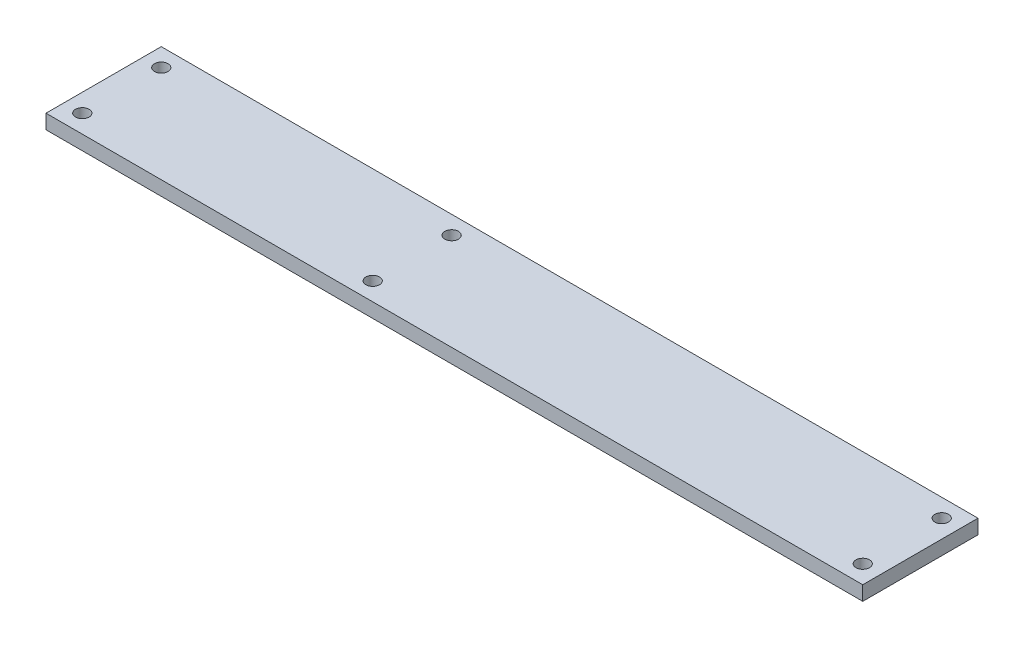
ISO-10303-21;
HEADER;
FILE_DESCRIPTION(('STEP AP214'),'2;1');
FILE_NAME('part.step','',(''),(''),'','','');
FILE_SCHEMA(('AUTOMOTIVE_DESIGN { 1 0 10303 214 1 1 1 1 }'));
ENDSEC;
DATA;
#1=APPLICATION_CONTEXT('core data for automotive mechanical design processes');
#2=APPLICATION_PROTOCOL_DEFINITION('international standard','automotive_design',2000,#1);
#3=PRODUCT_CONTEXT('',#1,'mechanical');
#4=PRODUCT('Part','Part','',(#3));
#5=PRODUCT_RELATED_PRODUCT_CATEGORY('part','',(#4));
#6=PRODUCT_DEFINITION_FORMATION('','',#4);
#7=PRODUCT_DEFINITION_CONTEXT('part definition',#1,'design');
#8=PRODUCT_DEFINITION('design','',#6,#7);
#9=PRODUCT_DEFINITION_SHAPE('','',#8);
#10=(LENGTH_UNIT() NAMED_UNIT(*) SI_UNIT(.MILLI.,.METRE.));
#11=(NAMED_UNIT(*) PLANE_ANGLE_UNIT() SI_UNIT($,.RADIAN.));
#12=(NAMED_UNIT(*) SI_UNIT($,.STERADIAN.) SOLID_ANGLE_UNIT());
#13=UNCERTAINTY_MEASURE_WITH_UNIT(LENGTH_MEASURE(1.E-05),#10,'distance_accuracy_value','');
#14=(GEOMETRIC_REPRESENTATION_CONTEXT(3) GLOBAL_UNCERTAINTY_ASSIGNED_CONTEXT((#13)) GLOBAL_UNIT_ASSIGNED_CONTEXT((#10,
#11,#12)) REPRESENTATION_CONTEXT('',''));
#15=CARTESIAN_POINT('',(0.,0.,0.));
#16=DIRECTION('',(0.,0.,1.));
#17=DIRECTION('',(1.,0.,0.));
#18=AXIS2_PLACEMENT_3D('',#15,#16,#17);
#19=CARTESIAN_POINT('',(0.,3.175,0.));
#20=DIRECTION('',(0.,-1.,0.));
#21=DIRECTION('',(0.,0.,-1.));
#22=AXIS2_PLACEMENT_3D('',#19,#20,#21);
#23=PLANE('',#22);
#24=DIRECTION('',(0.,0.,-1.));
#25=VECTOR('',#24,1.);
#26=CARTESIAN_POINT('',(90.,3.175,12.7));
#27=LINE('',#26,#25);
#28=CARTESIAN_POINT('',(90.,3.175,12.7));
#29=VERTEX_POINT('',#28);
#30=CARTESIAN_POINT('',(90.,3.175,-12.7));
#31=VERTEX_POINT('',#30);
#32=EDGE_CURVE('E86',#29,#31,#27,.T.);
#33=ORIENTED_EDGE('',*,*,#32,.T.);
#34=DIRECTION('',(-1.,0.,0.));
#35=VECTOR('',#34,1.);
#36=CARTESIAN_POINT('',(-90.,3.175,-12.7));
#37=LINE('',#36,#35);
#38=CARTESIAN_POINT('',(-90.,3.175,-12.7));
#39=VERTEX_POINT('',#38);
#40=EDGE_CURVE('E81',#31,#39,#37,.T.);
#41=ORIENTED_EDGE('',*,*,#40,.T.);
#42=DIRECTION('',(0.,0.,1.));
#43=VECTOR('',#42,1.);
#44=CARTESIAN_POINT('',(-90.,3.175,12.7));
#45=LINE('',#44,#43);
#46=CARTESIAN_POINT('',(-90.,3.175,12.7));
#47=VERTEX_POINT('',#46);
#48=EDGE_CURVE('E84',#39,#47,#45,.T.);
#49=ORIENTED_EDGE('',*,*,#48,.T.);
#50=DIRECTION('',(1.,0.,0.));
#51=VECTOR('',#50,1.);
#52=CARTESIAN_POINT('',(-90.,3.175,12.7));
#53=LINE('',#52,#51);
#54=EDGE_CURVE('E51',#47,#29,#53,.T.);
#55=ORIENTED_EDGE('',*,*,#54,.T.);
#56=EDGE_LOOP('',(#33,#41,#49,#55));
#57=FACE_BOUND('',#56,.T.);
#58=CARTESIAN_POINT('',(-86.,3.175,-8.7));
#59=DIRECTION('',(0.,1.,0.));
#60=DIRECTION('',(0.,0.,1.));
#61=AXIS2_PLACEMENT_3D('',#58,#59,#60);
#62=CIRCLE('',#61,1.5);
#63=CARTESIAN_POINT('',(-86.,3.175,-7.2));
#64=VERTEX_POINT('',#63);
#65=EDGE_CURVE('E101',#64,#64,#62,.T.);
#66=ORIENTED_EDGE('',*,*,#65,.F.);
#67=EDGE_LOOP('',(#66));
#68=FACE_BOUND('',#67,.T.);
#69=CARTESIAN_POINT('',(-86.,3.175,8.7));
#70=DIRECTION('',(0.,1.,0.));
#71=DIRECTION('',(0.,0.,1.));
#72=AXIS2_PLACEMENT_3D('',#69,#70,#71);
#73=CIRCLE('',#72,1.5);
#74=CARTESIAN_POINT('',(-86.,3.175,10.2));
#75=VERTEX_POINT('',#74);
#76=EDGE_CURVE('E116',#75,#75,#73,.T.);
#77=ORIENTED_EDGE('',*,*,#76,.F.);
#78=EDGE_LOOP('',(#77));
#79=FACE_BOUND('',#78,.T.);
#80=CARTESIAN_POINT('',(86.,3.175,8.7));
#81=DIRECTION('',(0.,1.,0.));
#82=DIRECTION('',(0.,0.,1.));
#83=AXIS2_PLACEMENT_3D('',#80,#81,#82);
#84=CIRCLE('',#83,1.5);
#85=CARTESIAN_POINT('',(86.,3.175,10.2));
#86=VERTEX_POINT('',#85);
#87=EDGE_CURVE('E122',#86,#86,#84,.T.);
#88=ORIENTED_EDGE('',*,*,#87,.F.);
#89=EDGE_LOOP('',(#88));
#90=FACE_BOUND('',#89,.T.);
#91=CARTESIAN_POINT('',(86.,3.175,-8.7));
#92=DIRECTION('',(0.,1.,0.));
#93=DIRECTION('',(0.,0.,1.));
#94=AXIS2_PLACEMENT_3D('',#91,#92,#93);
#95=CIRCLE('',#94,1.5);
#96=CARTESIAN_POINT('',(86.,3.175,-7.2));
#97=VERTEX_POINT('',#96);
#98=EDGE_CURVE('E128',#97,#97,#95,.T.);
#99=ORIENTED_EDGE('',*,*,#98,.F.);
#100=EDGE_LOOP('',(#99));
#101=FACE_BOUND('',#100,.T.);
#102=CARTESIAN_POINT('',(-22.,3.175,-8.7));
#103=DIRECTION('',(0.,1.,0.));
#104=DIRECTION('',(0.,0.,1.));
#105=AXIS2_PLACEMENT_3D('',#102,#103,#104);
#106=CIRCLE('',#105,1.5);
#107=CARTESIAN_POINT('',(-22.,3.175,-7.19999999999999));
#108=VERTEX_POINT('',#107);
#109=EDGE_CURVE('E134',#108,#108,#106,.T.);
#110=ORIENTED_EDGE('',*,*,#109,.F.);
#111=EDGE_LOOP('',(#110));
#112=FACE_BOUND('',#111,.T.);
#113=CARTESIAN_POINT('',(-22.,3.175,8.7));
#114=DIRECTION('',(0.,1.,0.));
#115=DIRECTION('',(0.,0.,1.));
#116=AXIS2_PLACEMENT_3D('',#113,#114,#115);
#117=CIRCLE('',#116,1.5);
#118=CARTESIAN_POINT('',(-22.,3.175,10.2));
#119=VERTEX_POINT('',#118);
#120=EDGE_CURVE('E140',#119,#119,#117,.T.);
#121=ORIENTED_EDGE('',*,*,#120,.F.);
#122=EDGE_LOOP('',(#121));
#123=FACE_BOUND('',#122,.T.);
#124=ADVANCED_FACE('F34',(#57,#68,#79,#90,#101,#112,#123),#23,.F.);
#125=CARTESIAN_POINT('',(0.,0.,0.));
#126=DIRECTION('',(0.,-1.,0.));
#127=DIRECTION('',(0.,0.,-1.));
#128=AXIS2_PLACEMENT_3D('',#125,#126,#127);
#129=PLANE('',#128);
#130=CARTESIAN_POINT('',(-22.,0.,-8.7));
#131=DIRECTION('',(0.,1.,0.));
#132=DIRECTION('',(0.,0.,1.));
#133=AXIS2_PLACEMENT_3D('',#130,#131,#132);
#134=CIRCLE('',#133,1.5);
#135=CARTESIAN_POINT('',(-22.,0.,-7.19999999999999));
#136=VERTEX_POINT('',#135);
#137=EDGE_CURVE('E137',#136,#136,#134,.T.);
#138=ORIENTED_EDGE('',*,*,#137,.T.);
#139=EDGE_LOOP('',(#138));
#140=FACE_BOUND('',#139,.T.);
#141=CARTESIAN_POINT('',(86.,0.,8.7));
#142=DIRECTION('',(0.,1.,0.));
#143=DIRECTION('',(0.,0.,1.));
#144=AXIS2_PLACEMENT_3D('',#141,#142,#143);
#145=CIRCLE('',#144,1.5);
#146=CARTESIAN_POINT('',(86.,0.,10.2));
#147=VERTEX_POINT('',#146);
#148=EDGE_CURVE('E125',#147,#147,#145,.T.);
#149=ORIENTED_EDGE('',*,*,#148,.T.);
#150=EDGE_LOOP('',(#149));
#151=FACE_BOUND('',#150,.T.);
#152=CARTESIAN_POINT('',(-86.,0.,-8.7));
#153=DIRECTION('',(0.,1.,0.));
#154=DIRECTION('',(0.,0.,1.));
#155=AXIS2_PLACEMENT_3D('',#152,#153,#154);
#156=CIRCLE('',#155,1.5);
#157=CARTESIAN_POINT('',(-86.,0.,-7.2));
#158=VERTEX_POINT('',#157);
#159=EDGE_CURVE('E113',#158,#158,#156,.T.);
#160=ORIENTED_EDGE('',*,*,#159,.T.);
#161=EDGE_LOOP('',(#160));
#162=FACE_BOUND('',#161,.T.);
#163=DIRECTION('',(0.,0.,-1.));
#164=VECTOR('',#163,1.);
#165=CARTESIAN_POINT('',(90.,0.,12.7));
#166=LINE('',#165,#164);
#167=CARTESIAN_POINT('',(90.,0.,12.7));
#168=VERTEX_POINT('',#167);
#169=CARTESIAN_POINT('',(90.,0.,-12.7));
#170=VERTEX_POINT('',#169);
#171=EDGE_CURVE('E98',#168,#170,#166,.T.);
#172=ORIENTED_EDGE('',*,*,#171,.F.);
#173=DIRECTION('',(1.,0.,0.));
#174=VECTOR('',#173,1.);
#175=CARTESIAN_POINT('',(-90.,0.,12.7));
#176=LINE('',#175,#174);
#177=CARTESIAN_POINT('',(-90.,0.,12.7));
#178=VERTEX_POINT('',#177);
#179=EDGE_CURVE('E74',#178,#168,#176,.T.);
#180=ORIENTED_EDGE('',*,*,#179,.F.);
#181=DIRECTION('',(0.,0.,1.));
#182=VECTOR('',#181,1.);
#183=CARTESIAN_POINT('',(-90.,0.,12.7));
#184=LINE('',#183,#182);
#185=CARTESIAN_POINT('',(-90.,0.,-12.7));
#186=VERTEX_POINT('',#185);
#187=EDGE_CURVE('E68',#186,#178,#184,.T.);
#188=ORIENTED_EDGE('',*,*,#187,.F.);
#189=DIRECTION('',(-1.,0.,0.));
#190=VECTOR('',#189,1.);
#191=CARTESIAN_POINT('',(-90.,0.,-12.7));
#192=LINE('',#191,#190);
#193=EDGE_CURVE('E90',#170,#186,#192,.T.);
#194=ORIENTED_EDGE('',*,*,#193,.F.);
#195=EDGE_LOOP('',(#172,#180,#188,#194));
#196=FACE_BOUND('',#195,.T.);
#197=CARTESIAN_POINT('',(-86.,0.,8.7));
#198=DIRECTION('',(0.,1.,0.));
#199=DIRECTION('',(0.,0.,1.));
#200=AXIS2_PLACEMENT_3D('',#197,#198,#199);
#201=CIRCLE('',#200,1.5);
#202=CARTESIAN_POINT('',(-86.,0.,10.2));
#203=VERTEX_POINT('',#202);
#204=EDGE_CURVE('E119',#203,#203,#201,.T.);
#205=ORIENTED_EDGE('',*,*,#204,.T.);
#206=EDGE_LOOP('',(#205));
#207=FACE_BOUND('',#206,.T.);
#208=CARTESIAN_POINT('',(86.,0.,-8.7));
#209=DIRECTION('',(0.,1.,0.));
#210=DIRECTION('',(0.,0.,1.));
#211=AXIS2_PLACEMENT_3D('',#208,#209,#210);
#212=CIRCLE('',#211,1.5);
#213=CARTESIAN_POINT('',(86.,0.,-7.2));
#214=VERTEX_POINT('',#213);
#215=EDGE_CURVE('E131',#214,#214,#212,.T.);
#216=ORIENTED_EDGE('',*,*,#215,.T.);
#217=EDGE_LOOP('',(#216));
#218=FACE_BOUND('',#217,.T.);
#219=CARTESIAN_POINT('',(-22.,0.,8.7));
#220=DIRECTION('',(0.,1.,0.));
#221=DIRECTION('',(0.,0.,1.));
#222=AXIS2_PLACEMENT_3D('',#219,#220,#221);
#223=CIRCLE('',#222,1.5);
#224=CARTESIAN_POINT('',(-22.,0.,10.2));
#225=VERTEX_POINT('',#224);
#226=EDGE_CURVE('E143',#225,#225,#223,.T.);
#227=ORIENTED_EDGE('',*,*,#226,.T.);
#228=EDGE_LOOP('',(#227));
#229=FACE_BOUND('',#228,.T.);
#230=ADVANCED_FACE('F109',(#140,#151,#162,#196,#207,#218,#229),#129,.T.);
#231=CARTESIAN_POINT('',(90.,3.175,12.7));
#232=DIRECTION('',(-1.,0.,0.));
#233=DIRECTION('',(0.,0.,1.));
#234=AXIS2_PLACEMENT_3D('',#231,#232,#233);
#235=PLANE('',#234);
#236=ORIENTED_EDGE('',*,*,#171,.T.);
#237=DIRECTION('',(0.,-1.,0.));
#238=VECTOR('',#237,1.);
#239=CARTESIAN_POINT('',(90.,3.175,-12.7));
#240=LINE('',#239,#238);
#241=EDGE_CURVE('E11',#31,#170,#240,.T.);
#242=ORIENTED_EDGE('',*,*,#241,.F.);
#243=ORIENTED_EDGE('',*,*,#32,.F.);
#244=DIRECTION('',(0.,-1.,0.));
#245=VECTOR('',#244,1.);
#246=CARTESIAN_POINT('',(90.,3.175,12.7));
#247=LINE('',#246,#245);
#248=EDGE_CURVE('E94',#29,#168,#247,.T.);
#249=ORIENTED_EDGE('',*,*,#248,.T.);
#250=EDGE_LOOP('',(#236,#242,#243,#249));
#251=FACE_BOUND('',#250,.T.);
#252=ADVANCED_FACE('F36',(#251),#235,.F.);
#253=CARTESIAN_POINT('',(-90.,3.175,-12.7));
#254=DIRECTION('',(0.,0.,1.));
#255=DIRECTION('',(1.,0.,0.));
#256=AXIS2_PLACEMENT_3D('',#253,#254,#255);
#257=PLANE('',#256);
#258=ORIENTED_EDGE('',*,*,#193,.T.);
#259=DIRECTION('',(0.,-1.,0.));
#260=VECTOR('',#259,1.);
#261=CARTESIAN_POINT('',(-90.,3.175,-12.7));
#262=LINE('',#261,#260);
#263=EDGE_CURVE('E43',#39,#186,#262,.T.);
#264=ORIENTED_EDGE('',*,*,#263,.F.);
#265=ORIENTED_EDGE('',*,*,#40,.F.);
#266=ORIENTED_EDGE('',*,*,#241,.T.);
#267=EDGE_LOOP('',(#258,#264,#265,#266));
#268=FACE_BOUND('',#267,.T.);
#269=ADVANCED_FACE('F89',(#268),#257,.F.);
#270=CARTESIAN_POINT('',(-90.,3.175,12.7));
#271=DIRECTION('',(1.,0.,0.));
#272=DIRECTION('',(0.,0.,-1.));
#273=AXIS2_PLACEMENT_3D('',#270,#271,#272);
#274=PLANE('',#273);
#275=ORIENTED_EDGE('',*,*,#187,.T.);
#276=DIRECTION('',(0.,-1.,0.));
#277=VECTOR('',#276,1.);
#278=CARTESIAN_POINT('',(-90.,3.175,12.7));
#279=LINE('',#278,#277);
#280=EDGE_CURVE('E91',#47,#178,#279,.T.);
#281=ORIENTED_EDGE('',*,*,#280,.F.);
#282=ORIENTED_EDGE('',*,*,#48,.F.);
#283=ORIENTED_EDGE('',*,*,#263,.T.);
#284=EDGE_LOOP('',(#275,#281,#282,#283));
#285=FACE_BOUND('',#284,.T.);
#286=ADVANCED_FACE('F92',(#285),#274,.F.);
#287=CARTESIAN_POINT('',(-90.,3.175,12.7));
#288=DIRECTION('',(0.,0.,-1.));
#289=DIRECTION('',(-1.,0.,0.));
#290=AXIS2_PLACEMENT_3D('',#287,#288,#289);
#291=PLANE('',#290);
#292=ORIENTED_EDGE('',*,*,#179,.T.);
#293=ORIENTED_EDGE('',*,*,#248,.F.);
#294=ORIENTED_EDGE('',*,*,#54,.F.);
#295=ORIENTED_EDGE('',*,*,#280,.T.);
#296=EDGE_LOOP('',(#292,#293,#294,#295));
#297=FACE_BOUND('',#296,.T.);
#298=ADVANCED_FACE('F106',(#297),#291,.F.);
#299=CARTESIAN_POINT('',(-86.,3.175,-8.7));
#300=DIRECTION('',(0.,-1.,0.));
#301=DIRECTION('',(0.,0.,-1.));
#302=AXIS2_PLACEMENT_3D('',#299,#300,#301);
#303=CYLINDRICAL_SURFACE('',#302,1.5);
#304=ORIENTED_EDGE('',*,*,#65,.T.);
#305=EDGE_LOOP('',(#304));
#306=FACE_BOUND('',#305,.T.);
#307=ORIENTED_EDGE('',*,*,#159,.F.);
#308=EDGE_LOOP('',(#307));
#309=FACE_BOUND('',#308,.T.);
#310=ADVANCED_FACE('F160',(#306,#309),#303,.F.);
#311=CARTESIAN_POINT('',(-86.,3.175,8.7));
#312=DIRECTION('',(0.,-1.,0.));
#313=DIRECTION('',(0.,0.,-1.));
#314=AXIS2_PLACEMENT_3D('',#311,#312,#313);
#315=CYLINDRICAL_SURFACE('',#314,1.5);
#316=ORIENTED_EDGE('',*,*,#76,.T.);
#317=EDGE_LOOP('',(#316));
#318=FACE_BOUND('',#317,.T.);
#319=ORIENTED_EDGE('',*,*,#204,.F.);
#320=EDGE_LOOP('',(#319));
#321=FACE_BOUND('',#320,.T.);
#322=ADVANCED_FACE('F206',(#318,#321),#315,.F.);
#323=CARTESIAN_POINT('',(86.,3.175,8.7));
#324=DIRECTION('',(0.,-1.,0.));
#325=DIRECTION('',(0.,0.,-1.));
#326=AXIS2_PLACEMENT_3D('',#323,#324,#325);
#327=CYLINDRICAL_SURFACE('',#326,1.5);
#328=ORIENTED_EDGE('',*,*,#87,.T.);
#329=EDGE_LOOP('',(#328));
#330=FACE_BOUND('',#329,.T.);
#331=ORIENTED_EDGE('',*,*,#148,.F.);
#332=EDGE_LOOP('',(#331));
#333=FACE_BOUND('',#332,.T.);
#334=ADVANCED_FACE('F214',(#330,#333),#327,.F.);
#335=CARTESIAN_POINT('',(86.,3.175,-8.7));
#336=DIRECTION('',(0.,-1.,0.));
#337=DIRECTION('',(0.,0.,-1.));
#338=AXIS2_PLACEMENT_3D('',#335,#336,#337);
#339=CYLINDRICAL_SURFACE('',#338,1.5);
#340=ORIENTED_EDGE('',*,*,#98,.T.);
#341=EDGE_LOOP('',(#340));
#342=FACE_BOUND('',#341,.T.);
#343=ORIENTED_EDGE('',*,*,#215,.F.);
#344=EDGE_LOOP('',(#343));
#345=FACE_BOUND('',#344,.T.);
#346=ADVANCED_FACE('F222',(#342,#345),#339,.F.);
#347=CARTESIAN_POINT('',(-22.,3.175,-8.7));
#348=DIRECTION('',(0.,-1.,0.));
#349=DIRECTION('',(0.,0.,-1.));
#350=AXIS2_PLACEMENT_3D('',#347,#348,#349);
#351=CYLINDRICAL_SURFACE('',#350,1.5);
#352=ORIENTED_EDGE('',*,*,#109,.T.);
#353=EDGE_LOOP('',(#352));
#354=FACE_BOUND('',#353,.T.);
#355=ORIENTED_EDGE('',*,*,#137,.F.);
#356=EDGE_LOOP('',(#355));
#357=FACE_BOUND('',#356,.T.);
#358=ADVANCED_FACE('F231',(#354,#357),#351,.F.);
#359=CARTESIAN_POINT('',(-22.,3.175,8.7));
#360=DIRECTION('',(0.,-1.,0.));
#361=DIRECTION('',(0.,0.,-1.));
#362=AXIS2_PLACEMENT_3D('',#359,#360,#361);
#363=CYLINDRICAL_SURFACE('',#362,1.5);
#364=ORIENTED_EDGE('',*,*,#120,.T.);
#365=EDGE_LOOP('',(#364));
#366=FACE_BOUND('',#365,.T.);
#367=ORIENTED_EDGE('',*,*,#226,.F.);
#368=EDGE_LOOP('',(#367));
#369=FACE_BOUND('',#368,.T.);
#370=ADVANCED_FACE('F149',(#366,#369),#363,.F.);
#371=CLOSED_SHELL('',(#124,#230,#252,#269,#286,#298,#310,#322,#334,#346,#358,#370));
#372=MANIFOLD_SOLID_BREP('B2',#371);
#373=ADVANCED_BREP_SHAPE_REPRESENTATION('',(#18,#372),#14);
#374=SHAPE_DEFINITION_REPRESENTATION(#9,#373);
ENDSEC;
END-ISO-10303-21;
